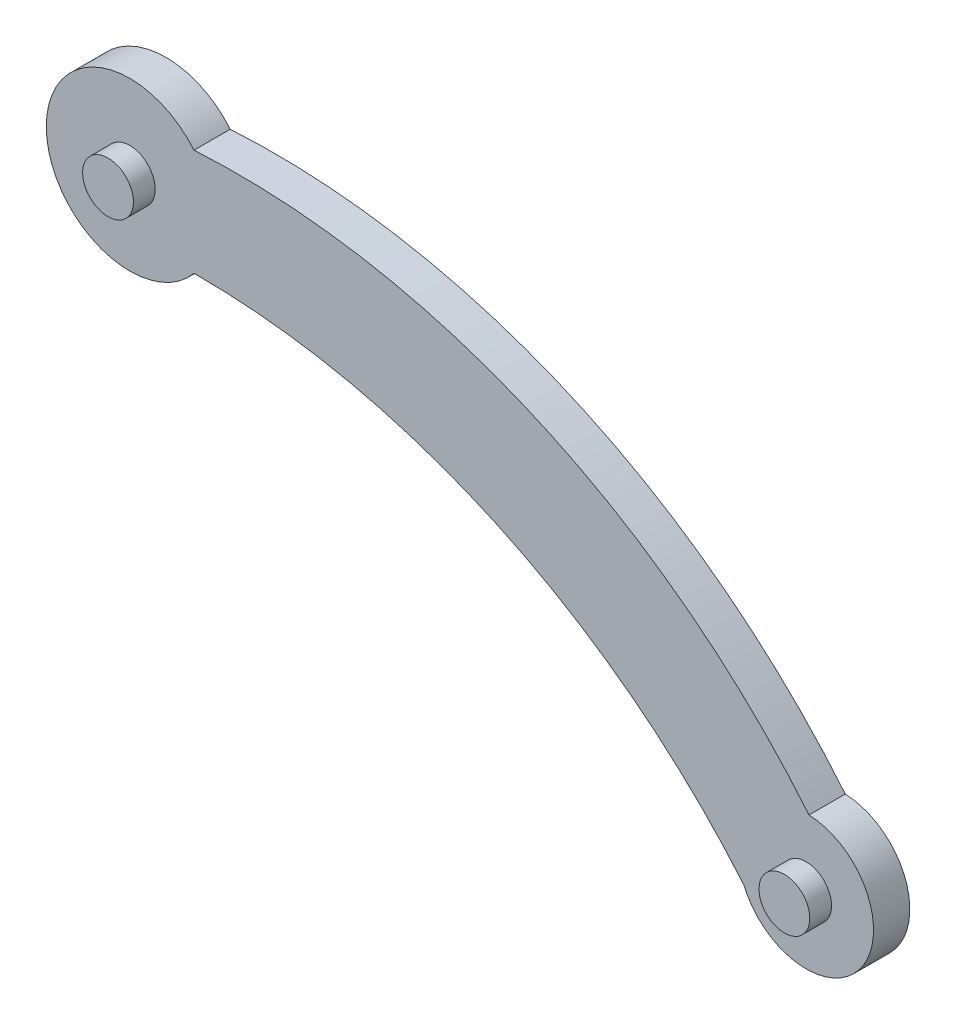
ISO-10303-21;
HEADER;
FILE_DESCRIPTION(('STEP AP214'),'2;1');
FILE_NAME('part.step','',(''),(''),'','','');
FILE_SCHEMA(('AUTOMOTIVE_DESIGN { 1 0 10303 214 1 1 1 1 }'));
ENDSEC;
DATA;
#1=APPLICATION_CONTEXT('core data for automotive mechanical design processes');
#2=APPLICATION_PROTOCOL_DEFINITION('international standard','automotive_design',2000,#1);
#3=PRODUCT_CONTEXT('',#1,'mechanical');
#4=PRODUCT('Part','Part','',(#3));
#5=PRODUCT_RELATED_PRODUCT_CATEGORY('part','',(#4));
#6=PRODUCT_DEFINITION_FORMATION('','',#4);
#7=PRODUCT_DEFINITION_CONTEXT('part definition',#1,'design');
#8=PRODUCT_DEFINITION('design','',#6,#7);
#9=PRODUCT_DEFINITION_SHAPE('','',#8);
#10=(LENGTH_UNIT() NAMED_UNIT(*) SI_UNIT(.MILLI.,.METRE.));
#11=(NAMED_UNIT(*) PLANE_ANGLE_UNIT() SI_UNIT($,.RADIAN.));
#12=(NAMED_UNIT(*) SI_UNIT($,.STERADIAN.) SOLID_ANGLE_UNIT());
#13=UNCERTAINTY_MEASURE_WITH_UNIT(LENGTH_MEASURE(1.E-05),#10,'distance_accuracy_value','');
#14=(GEOMETRIC_REPRESENTATION_CONTEXT(3) GLOBAL_UNCERTAINTY_ASSIGNED_CONTEXT((#13)) GLOBAL_UNIT_ASSIGNED_CONTEXT((#10,
#11,#12)) REPRESENTATION_CONTEXT('',''));
#15=CARTESIAN_POINT('',(0.,0.,0.));
#16=DIRECTION('',(0.,0.,1.));
#17=DIRECTION('',(1.,0.,0.));
#18=AXIS2_PLACEMENT_3D('',#15,#16,#17);
#19=CARTESIAN_POINT('',(-60.7952676012096,24.3566674306001,10.));
#20=DIRECTION('',(0.,0.,-1.));
#21=DIRECTION('',(-1.,0.,0.));
#22=AXIS2_PLACEMENT_3D('',#19,#20,#21);
#23=CYLINDRICAL_SURFACE('',#22,23.0161403393971);
#24=CARTESIAN_POINT('',(-60.7952676012096,24.3566674306001,0.));
#25=DIRECTION('',(0.,0.,1.));
#26=DIRECTION('',(1.,0.,0.));
#27=AXIS2_PLACEMENT_3D('',#24,#25,#26);
#28=CIRCLE('',#27,23.0161403393971);
#29=CARTESIAN_POINT('',(-43.0899878496436,39.0626452981751,0.));
#30=VERTEX_POINT('',#29);
#31=CARTESIAN_POINT('',(-43.0899878496436,9.65068956302506,0.));
#32=VERTEX_POINT('',#31);
#33=EDGE_CURVE('E110',#30,#32,#28,.T.);
#34=ORIENTED_EDGE('',*,*,#33,.T.);
#35=DIRECTION('',(0.,0.,-1.));
#36=VECTOR('',#35,1.);
#37=CARTESIAN_POINT('',(-43.0899878496436,9.65068956302506,10.));
#38=LINE('',#37,#36);
#39=CARTESIAN_POINT('',(-43.0899878496436,9.65068956302506,10.));
#40=VERTEX_POINT('',#39);
#41=EDGE_CURVE('E42',#40,#32,#38,.T.);
#42=ORIENTED_EDGE('',*,*,#41,.F.);
#43=CARTESIAN_POINT('',(-60.7952676012096,24.3566674306001,10.));
#44=DIRECTION('',(0.,0.,1.));
#45=DIRECTION('',(1.,0.,0.));
#46=AXIS2_PLACEMENT_3D('',#43,#44,#45);
#47=CIRCLE('',#46,23.0161403393971);
#48=CARTESIAN_POINT('',(-43.0899878496436,39.0626452981751,10.));
#49=VERTEX_POINT('',#48);
#50=EDGE_CURVE('E93',#49,#40,#47,.T.);
#51=ORIENTED_EDGE('',*,*,#50,.F.);
#52=DIRECTION('',(0.,0.,-1.));
#53=VECTOR('',#52,1.);
#54=CARTESIAN_POINT('',(-43.0899878496436,39.0626452981751,10.));
#55=LINE('',#54,#53);
#56=EDGE_CURVE('E106',#49,#30,#55,.T.);
#57=ORIENTED_EDGE('',*,*,#56,.T.);
#58=EDGE_LOOP('',(#34,#42,#51,#57));
#59=FACE_BOUND('',#58,.T.);
#60=ADVANCED_FACE('F39',(#59),#23,.T.);
#61=CARTESIAN_POINT('',(-42.2501191436592,-187.273978153699,10.));
#62=DIRECTION('',(0.,0.,-1.));
#63=DIRECTION('',(-1.,0.,0.));
#64=AXIS2_PLACEMENT_3D('',#61,#62,#63);
#65=CYLINDRICAL_SURFACE('',#64,196.926458696605);
#66=CARTESIAN_POINT('',(-42.2501191436592,-187.273978153699,0.));
#67=DIRECTION('',(0.,0.,-1.));
#68=DIRECTION('',(1.,0.,0.));
#69=AXIS2_PLACEMENT_3D('',#66,#67,#68);
#70=CIRCLE('',#69,196.926458696605);
#71=CARTESIAN_POINT('',(108.507084418539,-60.5763234441846,0.));
#72=VERTEX_POINT('',#71);
#73=EDGE_CURVE('E99',#32,#72,#70,.T.);
#74=ORIENTED_EDGE('',*,*,#73,.T.);
#75=DIRECTION('',(0.,0.,-1.));
#76=VECTOR('',#75,1.);
#77=CARTESIAN_POINT('',(108.507084418539,-60.5763234441846,10.));
#78=LINE('',#77,#76);
#79=CARTESIAN_POINT('',(108.507084418539,-60.5763234441846,10.));
#80=VERTEX_POINT('',#79);
#81=EDGE_CURVE('E97',#80,#72,#78,.T.);
#82=ORIENTED_EDGE('',*,*,#81,.F.);
#83=CARTESIAN_POINT('',(-42.2501191436592,-187.273978153699,10.));
#84=DIRECTION('',(0.,0.,-1.));
#85=DIRECTION('',(1.,0.,0.));
#86=AXIS2_PLACEMENT_3D('',#83,#84,#85);
#87=CIRCLE('',#86,196.926458696605);
#88=EDGE_CURVE('E88',#40,#80,#87,.T.);
#89=ORIENTED_EDGE('',*,*,#88,.F.);
#90=ORIENTED_EDGE('',*,*,#41,.T.);
#91=EDGE_LOOP('',(#74,#82,#89,#90));
#92=FACE_BOUND('',#91,.T.);
#93=ADVANCED_FACE('F98',(#92),#65,.F.);
#94=CARTESIAN_POINT('',(125.668384570753,-53.4447260122575,10.));
#95=DIRECTION('',(0.,0.,-1.));
#96=DIRECTION('',(-1.,0.,0.));
#97=AXIS2_PLACEMENT_3D('',#94,#95,#96);
#98=CYLINDRICAL_SURFACE('',#97,18.5841304570707);
#99=CARTESIAN_POINT('',(125.668384570753,-53.4447260122575,0.));
#100=DIRECTION('',(0.,0.,1.));
#101=DIRECTION('',(1.,0.,0.));
#102=AXIS2_PLACEMENT_3D('',#99,#100,#101);
#103=CIRCLE('',#102,18.5841304570707);
#104=CARTESIAN_POINT('',(126.455624698298,-34.8772771345305,0.));
#105=VERTEX_POINT('',#104);
#106=EDGE_CURVE('E74',#72,#105,#103,.T.);
#107=ORIENTED_EDGE('',*,*,#106,.T.);
#108=DIRECTION('',(0.,0.,-1.));
#109=VECTOR('',#108,1.);
#110=CARTESIAN_POINT('',(126.455624698298,-34.8772771345305,10.));
#111=LINE('',#110,#109);
#112=CARTESIAN_POINT('',(126.455624698298,-34.8772771345305,10.));
#113=VERTEX_POINT('',#112);
#114=EDGE_CURVE('E101',#113,#105,#111,.T.);
#115=ORIENTED_EDGE('',*,*,#114,.F.);
#116=CARTESIAN_POINT('',(125.668384570753,-53.4447260122575,10.));
#117=DIRECTION('',(0.,0.,1.));
#118=DIRECTION('',(1.,0.,0.));
#119=AXIS2_PLACEMENT_3D('',#116,#117,#118);
#120=CIRCLE('',#119,18.5841304570707);
#121=EDGE_CURVE('E91',#80,#113,#120,.T.);
#122=ORIENTED_EDGE('',*,*,#121,.F.);
#123=ORIENTED_EDGE('',*,*,#81,.T.);
#124=EDGE_LOOP('',(#107,#115,#122,#123));
#125=FACE_BOUND('',#124,.T.);
#126=ADVANCED_FACE('F102',(#125),#98,.T.);
#127=CARTESIAN_POINT('',(-30.8820915825154,-164.299999489,10.));
#128=DIRECTION('',(0.,0.,-1.));
#129=DIRECTION('',(-1.,0.,0.));
#130=AXIS2_PLACEMENT_3D('',#127,#128,#129);
#131=CYLINDRICAL_SURFACE('',#130,203.728736377821);
#132=CARTESIAN_POINT('',(-30.8820915825154,-164.299999489,0.));
#133=DIRECTION('',(0.,0.,1.));
#134=DIRECTION('',(-1.,0.,0.));
#135=AXIS2_PLACEMENT_3D('',#132,#133,#134);
#136=CIRCLE('',#135,203.728736377821);
#137=EDGE_CURVE('E80',#105,#30,#136,.T.);
#138=ORIENTED_EDGE('',*,*,#137,.T.);
#139=ORIENTED_EDGE('',*,*,#56,.F.);
#140=CARTESIAN_POINT('',(-30.8820915825154,-164.299999489,10.));
#141=DIRECTION('',(0.,0.,1.));
#142=DIRECTION('',(-1.,0.,0.));
#143=AXIS2_PLACEMENT_3D('',#140,#141,#142);
#144=CIRCLE('',#143,203.728736377821);
#145=EDGE_CURVE('E57',#113,#49,#144,.T.);
#146=ORIENTED_EDGE('',*,*,#145,.F.);
#147=ORIENTED_EDGE('',*,*,#114,.T.);
#148=EDGE_LOOP('',(#138,#139,#146,#147));
#149=FACE_BOUND('',#148,.T.);
#150=ADVANCED_FACE('F124',(#149),#131,.T.);
#151=CARTESIAN_POINT('',(-51.5226933724344,-81.4586553615496,10.));
#152=DIRECTION('',(0.,0.,1.));
#153=DIRECTION('',(1.,0.,0.));
#154=AXIS2_PLACEMENT_3D('',#151,#152,#153);
#155=PLANE('',#154);
#156=CARTESIAN_POINT('',(125.668384570753,-53.4447260122575,10.));
#157=DIRECTION('',(0.,0.,1.));
#158=DIRECTION('',(1.,0.,0.));
#159=AXIS2_PLACEMENT_3D('',#156,#157,#158);
#160=CIRCLE('',#159,7.00000000000002);
#161=CARTESIAN_POINT('',(132.668384570753,-53.4447260122575,10.));
#162=VERTEX_POINT('',#161);
#163=EDGE_CURVE('E135',#162,#162,#160,.T.);
#164=ORIENTED_EDGE('',*,*,#163,.F.);
#165=EDGE_LOOP('',(#164));
#166=FACE_BOUND('',#165,.T.);
#167=CARTESIAN_POINT('',(-60.7952676012096,24.3566674306001,10.));
#168=DIRECTION('',(0.,0.,1.));
#169=DIRECTION('',(1.,0.,0.));
#170=AXIS2_PLACEMENT_3D('',#167,#168,#169);
#171=CIRCLE('',#170,7.);
#172=CARTESIAN_POINT('',(-53.7952676012096,24.3566674306001,10.));
#173=VERTEX_POINT('',#172);
#174=EDGE_CURVE('E11',#173,#173,#171,.T.);
#175=ORIENTED_EDGE('',*,*,#174,.F.);
#176=EDGE_LOOP('',(#175));
#177=FACE_BOUND('',#176,.T.);
#178=ORIENTED_EDGE('',*,*,#50,.T.);
#179=ORIENTED_EDGE('',*,*,#88,.T.);
#180=ORIENTED_EDGE('',*,*,#121,.T.);
#181=ORIENTED_EDGE('',*,*,#145,.T.);
#182=EDGE_LOOP('',(#178,#179,#180,#181));
#183=FACE_BOUND('',#182,.T.);
#184=ADVANCED_FACE('F89',(#166,#177,#183),#155,.T.);
#185=CARTESIAN_POINT('',(-51.5226933724344,-81.4586553615496,0.));
#186=DIRECTION('',(0.,0.,1.));
#187=DIRECTION('',(1.,0.,0.));
#188=AXIS2_PLACEMENT_3D('',#185,#186,#187);
#189=PLANE('',#188);
#190=ORIENTED_EDGE('',*,*,#33,.F.);
#191=ORIENTED_EDGE('',*,*,#137,.F.);
#192=ORIENTED_EDGE('',*,*,#106,.F.);
#193=ORIENTED_EDGE('',*,*,#73,.F.);
#194=EDGE_LOOP('',(#190,#191,#192,#193));
#195=FACE_BOUND('',#194,.T.);
#196=ADVANCED_FACE('F127',(#195),#189,.F.);
#197=CARTESIAN_POINT('',(-60.7952676012096,24.3566674306001,16.));
#198=DIRECTION('',(0.,0.,-1.));
#199=DIRECTION('',(-1.,0.,0.));
#200=AXIS2_PLACEMENT_3D('',#197,#198,#199);
#201=CYLINDRICAL_SURFACE('',#200,7.);
#202=CARTESIAN_POINT('',(-60.7952676012096,24.3566674306001,16.));
#203=DIRECTION('',(0.,0.,1.));
#204=DIRECTION('',(1.,0.,0.));
#205=AXIS2_PLACEMENT_3D('',#202,#203,#204);
#206=CIRCLE('',#205,7.);
#207=CARTESIAN_POINT('',(-53.7952676012096,24.3566674306001,16.));
#208=VERTEX_POINT('',#207);
#209=EDGE_CURVE('E114',#208,#208,#206,.T.);
#210=ORIENTED_EDGE('',*,*,#209,.F.);
#211=EDGE_LOOP('',(#210));
#212=FACE_BOUND('',#211,.T.);
#213=ORIENTED_EDGE('',*,*,#174,.T.);
#214=EDGE_LOOP('',(#213));
#215=FACE_BOUND('',#214,.T.);
#216=ADVANCED_FACE('F157',(#212,#215),#201,.T.);
#217=CARTESIAN_POINT('',(-60.7952676012096,24.3566674306001,16.));
#218=DIRECTION('',(0.,0.,1.));
#219=DIRECTION('',(1.,0.,0.));
#220=AXIS2_PLACEMENT_3D('',#217,#218,#219);
#221=PLANE('',#220);
#222=ORIENTED_EDGE('',*,*,#209,.T.);
#223=EDGE_LOOP('',(#222));
#224=FACE_BOUND('',#223,.T.);
#225=ADVANCED_FACE('F148',(#224),#221,.T.);
#226=CARTESIAN_POINT('',(125.668384570753,-53.4447260122575,16.));
#227=DIRECTION('',(0.,0.,-1.));
#228=DIRECTION('',(-1.,0.,0.));
#229=AXIS2_PLACEMENT_3D('',#226,#227,#228);
#230=CYLINDRICAL_SURFACE('',#229,7.00000000000002);
#231=CARTESIAN_POINT('',(125.668384570753,-53.4447260122575,16.));
#232=DIRECTION('',(0.,0.,1.));
#233=DIRECTION('',(1.,0.,0.));
#234=AXIS2_PLACEMENT_3D('',#231,#232,#233);
#235=CIRCLE('',#234,7.00000000000002);
#236=CARTESIAN_POINT('',(132.668384570753,-53.4447260122575,16.));
#237=VERTEX_POINT('',#236);
#238=EDGE_CURVE('E134',#237,#237,#235,.T.);
#239=ORIENTED_EDGE('',*,*,#238,.F.);
#240=EDGE_LOOP('',(#239));
#241=FACE_BOUND('',#240,.T.);
#242=ORIENTED_EDGE('',*,*,#163,.T.);
#243=EDGE_LOOP('',(#242));
#244=FACE_BOUND('',#243,.T.);
#245=ADVANCED_FACE('F145',(#241,#244),#230,.T.);
#246=CARTESIAN_POINT('',(125.668384570753,-53.4447260122575,16.));
#247=DIRECTION('',(0.,0.,1.));
#248=DIRECTION('',(1.,0.,0.));
#249=AXIS2_PLACEMENT_3D('',#246,#247,#248);
#250=PLANE('',#249);
#251=ORIENTED_EDGE('',*,*,#238,.T.);
#252=EDGE_LOOP('',(#251));
#253=FACE_BOUND('',#252,.T.);
#254=ADVANCED_FACE('F143',(#253),#250,.T.);
#255=CLOSED_SHELL('',(#60,#93,#126,#150,#184,#196,#216,#225,#245,#254));
#256=MANIFOLD_SOLID_BREP('B2',#255);
#257=ADVANCED_BREP_SHAPE_REPRESENTATION('',(#18,#256),#14);
#258=SHAPE_DEFINITION_REPRESENTATION(#9,#257);
ENDSEC;
END-ISO-10303-21;
